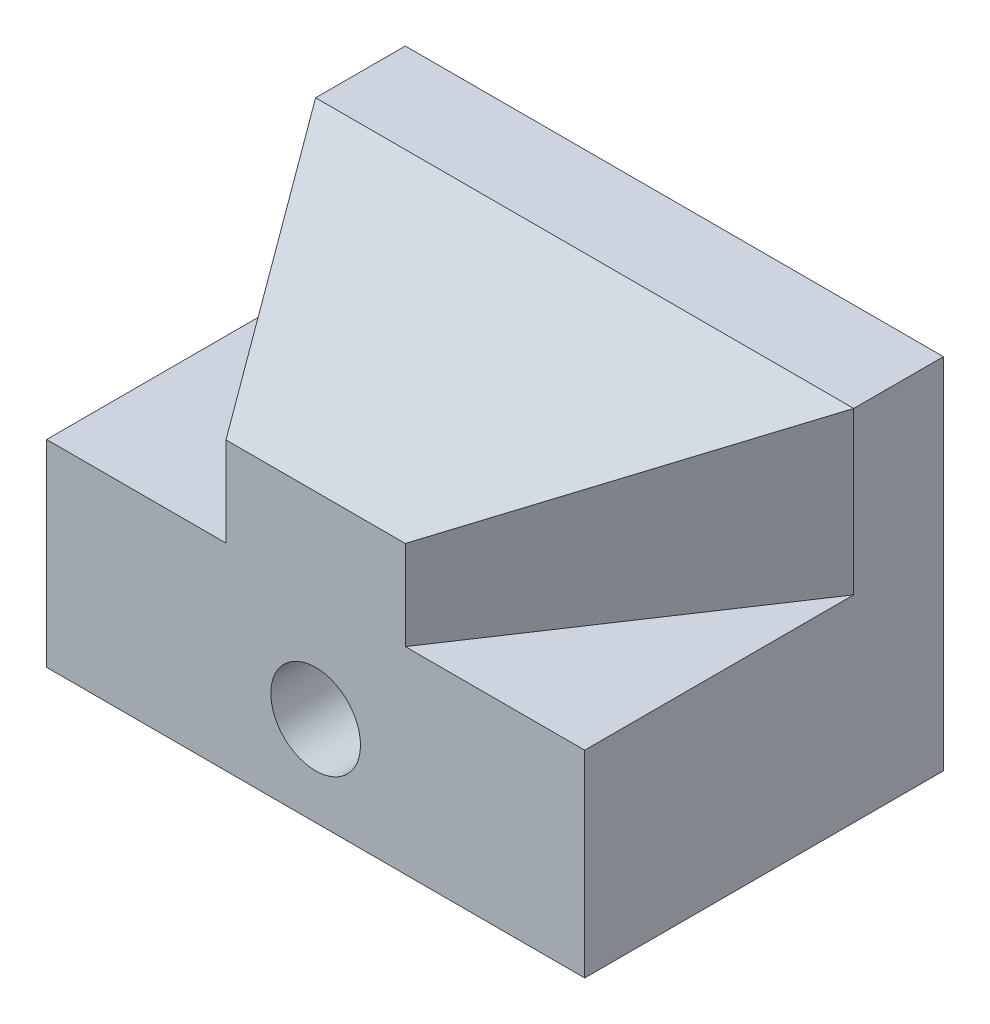
ISO-10303-21;
HEADER;
FILE_DESCRIPTION(('STEP AP214'),'2;1');
FILE_NAME('part.step','',(''),(''),'','','');
FILE_SCHEMA(('AUTOMOTIVE_DESIGN { 1 0 10303 214 1 1 1 1 }'));
ENDSEC;
DATA;
#1=APPLICATION_CONTEXT('core data for automotive mechanical design processes');
#2=APPLICATION_PROTOCOL_DEFINITION('international standard','automotive_design',2000,#1);
#3=PRODUCT_CONTEXT('',#1,'mechanical');
#4=PRODUCT('Part','Part','',(#3));
#5=PRODUCT_RELATED_PRODUCT_CATEGORY('part','',(#4));
#6=PRODUCT_DEFINITION_FORMATION('','',#4);
#7=PRODUCT_DEFINITION_CONTEXT('part definition',#1,'design');
#8=PRODUCT_DEFINITION('design','',#6,#7);
#9=PRODUCT_DEFINITION_SHAPE('','',#8);
#10=(LENGTH_UNIT() NAMED_UNIT(*) SI_UNIT(.MILLI.,.METRE.));
#11=(NAMED_UNIT(*) PLANE_ANGLE_UNIT() SI_UNIT($,.RADIAN.));
#12=(NAMED_UNIT(*) SI_UNIT($,.STERADIAN.) SOLID_ANGLE_UNIT());
#13=UNCERTAINTY_MEASURE_WITH_UNIT(LENGTH_MEASURE(1.E-05),#10,'distance_accuracy_value','');
#14=(GEOMETRIC_REPRESENTATION_CONTEXT(3) GLOBAL_UNCERTAINTY_ASSIGNED_CONTEXT((#13)) GLOBAL_UNIT_ASSIGNED_CONTEXT((#10,
#11,#12)) REPRESENTATION_CONTEXT('',''));
#15=CARTESIAN_POINT('',(0.,0.,0.));
#16=DIRECTION('',(0.,0.,1.));
#17=DIRECTION('',(1.,0.,0.));
#18=AXIS2_PLACEMENT_3D('',#15,#16,#17);
#19=CARTESIAN_POINT('',(0.,0.,50.8));
#20=DIRECTION('',(1.,0.,0.));
#21=DIRECTION('',(0.,0.,-1.));
#22=AXIS2_PLACEMENT_3D('',#19,#20,#21);
#23=PLANE('',#22);
#24=DIRECTION('',(0.,-1.,0.));
#25=VECTOR('',#24,1.);
#26=CARTESIAN_POINT('',(0.,50.800012,12.7));
#27=LINE('',#26,#25);
#28=CARTESIAN_POINT('',(0.,50.8,12.7));
#29=VERTEX_POINT('',#28);
#30=CARTESIAN_POINT('',(0.,27.94,12.7));
#31=VERTEX_POINT('',#30);
#32=EDGE_CURVE('E119',#29,#31,#27,.T.);
#33=ORIENTED_EDGE('',*,*,#32,.F.);
#34=DIRECTION('',(0.,0.,-1.));
#35=VECTOR('',#34,1.);
#36=CARTESIAN_POINT('',(0.,50.8,50.8));
#37=LINE('',#36,#35);
#38=CARTESIAN_POINT('',(0.,50.8,0.));
#39=VERTEX_POINT('',#38);
#40=EDGE_CURVE('E128',#29,#39,#37,.T.);
#41=ORIENTED_EDGE('',*,*,#40,.T.);
#42=DIRECTION('',(0.,-1.,0.));
#43=VECTOR('',#42,1.);
#44=CARTESIAN_POINT('',(0.,0.,0.));
#45=LINE('',#44,#43);
#46=CARTESIAN_POINT('',(0.,0.,0.));
#47=VERTEX_POINT('',#46);
#48=EDGE_CURVE('E198',#39,#47,#45,.T.);
#49=ORIENTED_EDGE('',*,*,#48,.T.);
#50=DIRECTION('',(0.,0.,-1.));
#51=VECTOR('',#50,1.);
#52=CARTESIAN_POINT('',(0.,0.,50.8));
#53=LINE('',#52,#51);
#54=CARTESIAN_POINT('',(0.,0.,50.8));
#55=VERTEX_POINT('',#54);
#56=EDGE_CURVE('E157',#55,#47,#53,.T.);
#57=ORIENTED_EDGE('',*,*,#56,.F.);
#58=DIRECTION('',(0.,-1.,0.));
#59=VECTOR('',#58,1.);
#60=CARTESIAN_POINT('',(0.,0.,50.8));
#61=LINE('',#60,#59);
#62=CARTESIAN_POINT('',(0.,27.94,50.8));
#63=VERTEX_POINT('',#62);
#64=EDGE_CURVE('E207',#63,#55,#61,.T.);
#65=ORIENTED_EDGE('',*,*,#64,.F.);
#66=DIRECTION('',(0.,0.,1.));
#67=VECTOR('',#66,1.);
#68=CARTESIAN_POINT('',(0.,27.94,12.7));
#69=LINE('',#68,#67);
#70=EDGE_CURVE('E131',#31,#63,#69,.T.);
#71=ORIENTED_EDGE('',*,*,#70,.F.);
#72=EDGE_LOOP('',(#33,#41,#49,#57,#65,#71));
#73=FACE_BOUND('',#72,.T.);
#74=ADVANCED_FACE('F45',(#73),#23,.F.);
#75=CARTESIAN_POINT('',(76.2,0.,50.8));
#76=DIRECTION('',(-1.,0.,0.));
#77=DIRECTION('',(0.,0.,1.));
#78=AXIS2_PLACEMENT_3D('',#75,#76,#77);
#79=PLANE('',#78);
#80=DIRECTION('',(0.,-1.,0.));
#81=VECTOR('',#80,1.);
#82=CARTESIAN_POINT('',(76.2,50.800012,12.7));
#83=LINE('',#82,#81);
#84=CARTESIAN_POINT('',(76.2,50.8,12.7));
#85=VERTEX_POINT('',#84);
#86=CARTESIAN_POINT('',(76.2,27.94,12.7));
#87=VERTEX_POINT('',#86);
#88=EDGE_CURVE('E195',#85,#87,#83,.T.);
#89=ORIENTED_EDGE('',*,*,#88,.T.);
#90=DIRECTION('',(0.,0.,-1.));
#91=VECTOR('',#90,1.);
#92=CARTESIAN_POINT('',(76.2,27.94,50.8));
#93=LINE('',#92,#91);
#94=CARTESIAN_POINT('',(76.2,27.94,50.8));
#95=VERTEX_POINT('',#94);
#96=EDGE_CURVE('E184',#95,#87,#93,.T.);
#97=ORIENTED_EDGE('',*,*,#96,.F.);
#98=DIRECTION('',(0.,1.,0.));
#99=VECTOR('',#98,1.);
#100=CARTESIAN_POINT('',(76.2,0.,50.8));
#101=LINE('',#100,#99);
#102=CARTESIAN_POINT('',(76.2,0.,50.8));
#103=VERTEX_POINT('',#102);
#104=EDGE_CURVE('E141',#103,#95,#101,.T.);
#105=ORIENTED_EDGE('',*,*,#104,.F.);
#106=DIRECTION('',(0.,0.,-1.));
#107=VECTOR('',#106,1.);
#108=CARTESIAN_POINT('',(76.2,0.,50.8));
#109=LINE('',#108,#107);
#110=CARTESIAN_POINT('',(76.2,0.,0.));
#111=VERTEX_POINT('',#110);
#112=EDGE_CURVE('E146',#103,#111,#109,.T.);
#113=ORIENTED_EDGE('',*,*,#112,.T.);
#114=DIRECTION('',(0.,1.,0.));
#115=VECTOR('',#114,1.);
#116=CARTESIAN_POINT('',(76.2,0.,0.));
#117=LINE('',#116,#115);
#118=CARTESIAN_POINT('',(76.2,50.8,0.));
#119=VERTEX_POINT('',#118);
#120=EDGE_CURVE('E216',#111,#119,#117,.T.);
#121=ORIENTED_EDGE('',*,*,#120,.T.);
#122=DIRECTION('',(0.,0.,-1.));
#123=VECTOR('',#122,1.);
#124=CARTESIAN_POINT('',(76.2,50.8,50.8));
#125=LINE('',#124,#123);
#126=EDGE_CURVE('E140',#85,#119,#125,.T.);
#127=ORIENTED_EDGE('',*,*,#126,.F.);
#128=EDGE_LOOP('',(#89,#97,#105,#113,#121,#127));
#129=FACE_BOUND('',#128,.T.);
#130=ADVANCED_FACE('F228',(#129),#79,.F.);
#131=CARTESIAN_POINT('',(0.,50.8,50.8));
#132=DIRECTION('',(0.,-1.,0.));
#133=DIRECTION('',(0.,0.,-1.));
#134=AXIS2_PLACEMENT_3D('',#131,#132,#133);
#135=PLANE('',#134);
#136=ORIENTED_EDGE('',*,*,#40,.F.);
#137=DIRECTION('',(1.,0.,0.));
#138=VECTOR('',#137,1.);
#139=CARTESIAN_POINT('',(0.,50.8,12.7));
#140=LINE('',#139,#138);
#141=EDGE_CURVE('E106',#29,#85,#140,.T.);
#142=ORIENTED_EDGE('',*,*,#141,.T.);
#143=ORIENTED_EDGE('',*,*,#126,.T.);
#144=DIRECTION('',(-1.,0.,0.));
#145=VECTOR('',#144,1.);
#146=CARTESIAN_POINT('',(0.,50.8,0.));
#147=LINE('',#146,#145);
#148=EDGE_CURVE('E137',#119,#39,#147,.T.);
#149=ORIENTED_EDGE('',*,*,#148,.T.);
#150=EDGE_LOOP('',(#136,#142,#143,#149));
#151=FACE_BOUND('',#150,.T.);
#152=ADVANCED_FACE('F135',(#151),#135,.F.);
#153=CARTESIAN_POINT('',(0.,0.,50.8));
#154=DIRECTION('',(0.,0.,-1.));
#155=DIRECTION('',(-1.,0.,0.));
#156=AXIS2_PLACEMENT_3D('',#153,#154,#155);
#157=PLANE('',#156);
#158=CARTESIAN_POINT('',(38.1,12.7,50.8));
#159=DIRECTION('',(0.,0.,1.));
#160=DIRECTION('',(1.,0.,0.));
#161=AXIS2_PLACEMENT_3D('',#158,#159,#160);
#162=CIRCLE('',#161,6.35);
#163=CARTESIAN_POINT('',(44.45,12.7,50.8));
#164=VERTEX_POINT('',#163);
#165=EDGE_CURVE('E170',#164,#164,#162,.T.);
#166=ORIENTED_EDGE('',*,*,#165,.F.);
#167=EDGE_LOOP('',(#166));
#168=FACE_BOUND('',#167,.T.);
#169=DIRECTION('',(0.,-1.,0.));
#170=VECTOR('',#169,1.);
#171=CARTESIAN_POINT('',(50.8,0.,50.8));
#172=LINE('',#171,#170);
#173=CARTESIAN_POINT('',(50.8,40.5911357683745,50.8));
#174=VERTEX_POINT('',#173);
#175=CARTESIAN_POINT('',(50.8,27.94,50.8));
#176=VERTEX_POINT('',#175);
#177=EDGE_CURVE('E53',#174,#176,#172,.T.);
#178=ORIENTED_EDGE('',*,*,#177,.F.);
#179=DIRECTION('',(1.,0.,0.));
#180=VECTOR('',#179,1.);
#181=CARTESIAN_POINT('',(0.,40.5911357683745,50.8));
#182=LINE('',#181,#180);
#183=CARTESIAN_POINT('',(25.4,40.5911357683745,50.8));
#184=VERTEX_POINT('',#183);
#185=EDGE_CURVE('E59',#184,#174,#182,.T.);
#186=ORIENTED_EDGE('',*,*,#185,.F.);
#187=DIRECTION('',(0.,1.,0.));
#188=VECTOR('',#187,1.);
#189=CARTESIAN_POINT('',(25.4,0.,50.8));
#190=LINE('',#189,#188);
#191=CARTESIAN_POINT('',(25.4,27.94,50.8));
#192=VERTEX_POINT('',#191);
#193=EDGE_CURVE('E122',#192,#184,#190,.T.);
#194=ORIENTED_EDGE('',*,*,#193,.F.);
#195=DIRECTION('',(1.,0.,0.));
#196=VECTOR('',#195,1.);
#197=CARTESIAN_POINT('',(0.,27.94,50.8));
#198=LINE('',#197,#196);
#199=EDGE_CURVE('E133',#63,#192,#198,.T.);
#200=ORIENTED_EDGE('',*,*,#199,.F.);
#201=ORIENTED_EDGE('',*,*,#64,.T.);
#202=DIRECTION('',(1.,0.,0.));
#203=VECTOR('',#202,1.);
#204=CARTESIAN_POINT('',(0.,0.,50.8));
#205=LINE('',#204,#203);
#206=EDGE_CURVE('E149',#55,#103,#205,.T.);
#207=ORIENTED_EDGE('',*,*,#206,.T.);
#208=ORIENTED_EDGE('',*,*,#104,.T.);
#209=DIRECTION('',(1.,0.,0.));
#210=VECTOR('',#209,1.);
#211=CARTESIAN_POINT('',(50.8,27.94,50.8));
#212=LINE('',#211,#210);
#213=EDGE_CURVE('E192',#176,#95,#212,.T.);
#214=ORIENTED_EDGE('',*,*,#213,.F.);
#215=EDGE_LOOP('',(#178,#186,#194,#200,#201,#207,#208,#214));
#216=FACE_BOUND('',#215,.T.);
#217=ADVANCED_FACE('F238',(#168,#216),#157,.F.);
#218=CARTESIAN_POINT('',(0.,0.,50.8));
#219=DIRECTION('',(0.,1.,0.));
#220=DIRECTION('',(0.,0.,1.));
#221=AXIS2_PLACEMENT_3D('',#218,#219,#220);
#222=PLANE('',#221);
#223=DIRECTION('',(1.,0.,0.));
#224=VECTOR('',#223,1.);
#225=CARTESIAN_POINT('',(0.,0.,0.));
#226=LINE('',#225,#224);
#227=EDGE_CURVE('E214',#47,#111,#226,.T.);
#228=ORIENTED_EDGE('',*,*,#227,.T.);
#229=ORIENTED_EDGE('',*,*,#112,.F.);
#230=ORIENTED_EDGE('',*,*,#206,.F.);
#231=ORIENTED_EDGE('',*,*,#56,.T.);
#232=EDGE_LOOP('',(#228,#229,#230,#231));
#233=FACE_BOUND('',#232,.T.);
#234=ADVANCED_FACE('F236',(#233),#222,.F.);
#235=CARTESIAN_POINT('',(0.,0.,0.));
#236=DIRECTION('',(0.,0.,-1.));
#237=DIRECTION('',(-1.,0.,0.));
#238=AXIS2_PLACEMENT_3D('',#235,#236,#237);
#239=PLANE('',#238);
#240=CARTESIAN_POINT('',(38.1,12.7,0.));
#241=DIRECTION('',(0.,0.,1.));
#242=DIRECTION('',(1.,0.,0.));
#243=AXIS2_PLACEMENT_3D('',#240,#241,#242);
#244=CIRCLE('',#243,6.35);
#245=CARTESIAN_POINT('',(44.45,12.7,0.));
#246=VERTEX_POINT('',#245);
#247=EDGE_CURVE('E174',#246,#246,#244,.T.);
#248=ORIENTED_EDGE('',*,*,#247,.T.);
#249=EDGE_LOOP('',(#248));
#250=FACE_BOUND('',#249,.T.);
#251=ORIENTED_EDGE('',*,*,#48,.F.);
#252=ORIENTED_EDGE('',*,*,#148,.F.);
#253=ORIENTED_EDGE('',*,*,#120,.F.);
#254=ORIENTED_EDGE('',*,*,#227,.F.);
#255=EDGE_LOOP('',(#251,#252,#253,#254));
#256=FACE_BOUND('',#255,.T.);
#257=ADVANCED_FACE('F232',(#250,#256),#239,.T.);
#258=CARTESIAN_POINT('',(25.4,50.800012,50.8));
#259=DIRECTION('',(-0.832050294337844,0.,0.554700196225229));
#260=DIRECTION('',(0.554700196225229,0.,0.832050294337844));
#261=AXIS2_PLACEMENT_3D('',#258,#259,#260);
#262=PLANE('',#261);
#263=DIRECTION('',(0.541407904653557,-0.217604716241615,0.812111856980336));
#264=VECTOR('',#263,1.);
#265=CARTESIAN_POINT('',(24.197262547968,41.0745445618425,48.9958938219519));
#266=LINE('',#265,#264);
#267=EDGE_CURVE('E109',#29,#184,#266,.T.);
#268=ORIENTED_EDGE('',*,*,#267,.F.);
#269=ORIENTED_EDGE('',*,*,#32,.T.);
#270=DIRECTION('',(-0.554700196225229,0.,-0.832050294337844));
#271=VECTOR('',#270,1.);
#272=CARTESIAN_POINT('',(25.4,27.94,50.8));
#273=LINE('',#272,#271);
#274=EDGE_CURVE('E189',#192,#31,#273,.T.);
#275=ORIENTED_EDGE('',*,*,#274,.F.);
#276=ORIENTED_EDGE('',*,*,#193,.T.);
#277=EDGE_LOOP('',(#268,#269,#275,#276));
#278=FACE_BOUND('',#277,.T.);
#279=ADVANCED_FACE('F118',(#278),#262,.T.);
#280=CARTESIAN_POINT('',(0.,27.94,0.));
#281=DIRECTION('',(0.,-1.,0.));
#282=DIRECTION('',(0.,0.,-1.));
#283=AXIS2_PLACEMENT_3D('',#280,#281,#282);
#284=PLANE('',#283);
#285=ORIENTED_EDGE('',*,*,#274,.T.);
#286=ORIENTED_EDGE('',*,*,#70,.T.);
#287=ORIENTED_EDGE('',*,*,#199,.T.);
#288=EDGE_LOOP('',(#285,#286,#287));
#289=FACE_BOUND('',#288,.T.);
#290=ADVANCED_FACE('F242',(#289),#284,.F.);
#291=CARTESIAN_POINT('',(76.2,50.800012,12.7));
#292=DIRECTION('',(0.832050294337844,0.,0.554700196225229));
#293=DIRECTION('',(0.554700196225229,0.,-0.832050294337844));
#294=AXIS2_PLACEMENT_3D('',#291,#292,#293);
#295=PLANE('',#294);
#296=DIRECTION('',(0.541407904653557,0.217604716241615,-0.812111856980336));
#297=VECTOR('',#296,1.);
#298=CARTESIAN_POINT('',(76.200001413755,50.8000005682217,12.6999978793676));
#299=LINE('',#298,#297);
#300=EDGE_CURVE('E11',#174,#85,#299,.T.);
#301=ORIENTED_EDGE('',*,*,#300,.F.);
#302=ORIENTED_EDGE('',*,*,#177,.T.);
#303=DIRECTION('',(-0.554700196225229,0.,0.832050294337844));
#304=VECTOR('',#303,1.);
#305=CARTESIAN_POINT('',(76.2,27.94,12.7));
#306=LINE('',#305,#304);
#307=EDGE_CURVE('E188',#87,#176,#306,.T.);
#308=ORIENTED_EDGE('',*,*,#307,.F.);
#309=ORIENTED_EDGE('',*,*,#88,.F.);
#310=EDGE_LOOP('',(#301,#302,#308,#309));
#311=FACE_BOUND('',#310,.T.);
#312=ADVANCED_FACE('F244',(#311),#295,.T.);
#313=CARTESIAN_POINT('',(0.,27.94,0.));
#314=DIRECTION('',(0.,-1.,0.));
#315=DIRECTION('',(0.,0.,-1.));
#316=AXIS2_PLACEMENT_3D('',#313,#314,#315);
#317=PLANE('',#316);
#318=ORIENTED_EDGE('',*,*,#96,.T.);
#319=ORIENTED_EDGE('',*,*,#307,.T.);
#320=ORIENTED_EDGE('',*,*,#213,.T.);
#321=EDGE_LOOP('',(#318,#319,#320));
#322=FACE_BOUND('',#321,.T.);
#323=ADVANCED_FACE('F251',(#322),#317,.F.);
#324=CARTESIAN_POINT('',(0.,50.8,12.7));
#325=DIRECTION('',(0.,-0.96592582628907,-0.258819045102515));
#326=DIRECTION('',(0.,0.258819045102515,-0.96592582628907));
#327=AXIS2_PLACEMENT_3D('',#324,#325,#326);
#328=PLANE('',#327);
#329=ORIENTED_EDGE('',*,*,#267,.T.);
#330=ORIENTED_EDGE('',*,*,#185,.T.);
#331=ORIENTED_EDGE('',*,*,#300,.T.);
#332=ORIENTED_EDGE('',*,*,#141,.F.);
#333=EDGE_LOOP('',(#329,#330,#331,#332));
#334=FACE_BOUND('',#333,.T.);
#335=ADVANCED_FACE('F108',(#334),#328,.F.);
#336=CARTESIAN_POINT('',(38.1,12.7,0.));
#337=DIRECTION('',(0.,0.,1.));
#338=DIRECTION('',(1.,0.,0.));
#339=AXIS2_PLACEMENT_3D('',#336,#337,#338);
#340=CYLINDRICAL_SURFACE('',#339,6.35);
#341=ORIENTED_EDGE('',*,*,#247,.F.);
#342=EDGE_LOOP('',(#341));
#343=FACE_BOUND('',#342,.T.);
#344=ORIENTED_EDGE('',*,*,#165,.T.);
#345=EDGE_LOOP('',(#344));
#346=FACE_BOUND('',#345,.T.);
#347=ADVANCED_FACE('F276',(#343,#346),#340,.F.);
#348=CLOSED_SHELL('',(#74,#130,#152,#217,#234,#257,#279,#290,#312,#323,#335,#347));
#349=MANIFOLD_SOLID_BREP('B2',#348);
#350=ADVANCED_BREP_SHAPE_REPRESENTATION('',(#18,#349),#14);
#351=SHAPE_DEFINITION_REPRESENTATION(#9,#350);
ENDSEC;
END-ISO-10303-21;
